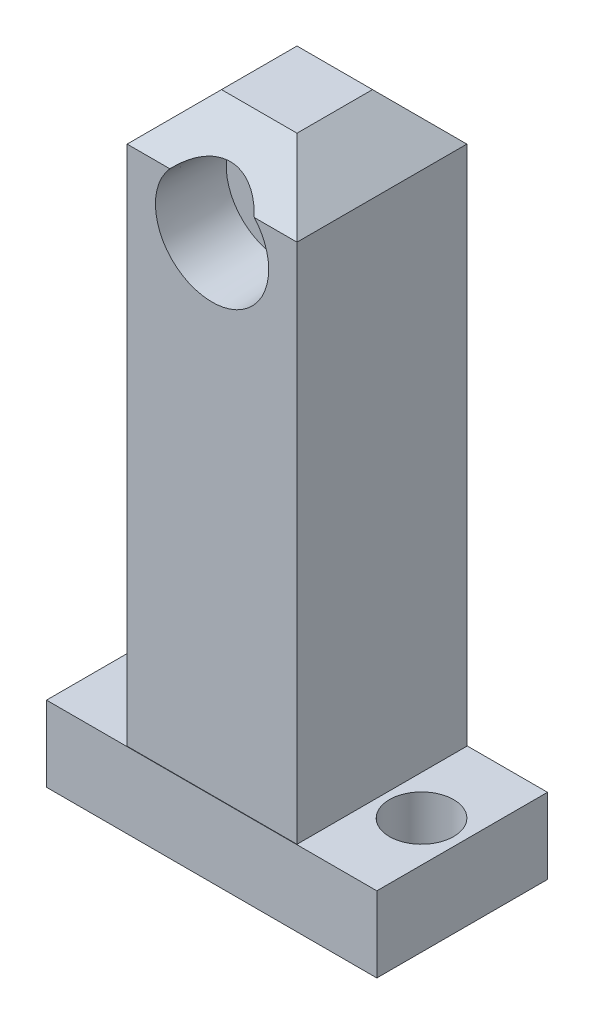
ISO-10303-21;
HEADER;
FILE_DESCRIPTION(('STEP AP214'),'2;1');
FILE_NAME('part.step','',(''),(''),'','','');
FILE_SCHEMA(('AUTOMOTIVE_DESIGN { 1 0 10303 214 1 1 1 1 }'));
ENDSEC;
DATA;
#1=APPLICATION_CONTEXT('core data for automotive mechanical design processes');
#2=APPLICATION_PROTOCOL_DEFINITION('international standard','automotive_design',2000,#1);
#3=PRODUCT_CONTEXT('',#1,'mechanical');
#4=PRODUCT('Part','Part','',(#3));
#5=PRODUCT_RELATED_PRODUCT_CATEGORY('part','',(#4));
#6=PRODUCT_DEFINITION_FORMATION('','',#4);
#7=PRODUCT_DEFINITION_CONTEXT('part definition',#1,'design');
#8=PRODUCT_DEFINITION('design','',#6,#7);
#9=PRODUCT_DEFINITION_SHAPE('','',#8);
#10=(LENGTH_UNIT() NAMED_UNIT(*) SI_UNIT(.MILLI.,.METRE.));
#11=(NAMED_UNIT(*) PLANE_ANGLE_UNIT() SI_UNIT($,.RADIAN.));
#12=(NAMED_UNIT(*) SI_UNIT($,.STERADIAN.) SOLID_ANGLE_UNIT());
#13=UNCERTAINTY_MEASURE_WITH_UNIT(LENGTH_MEASURE(1.E-05),#10,'distance_accuracy_value','');
#14=(GEOMETRIC_REPRESENTATION_CONTEXT(3) GLOBAL_UNCERTAINTY_ASSIGNED_CONTEXT((#13)) GLOBAL_UNIT_ASSIGNED_CONTEXT((#10,
#11,#12)) REPRESENTATION_CONTEXT('',''));
#15=CARTESIAN_POINT('',(0.,0.,0.));
#16=DIRECTION('',(0.,0.,1.));
#17=DIRECTION('',(1.,0.,0.));
#18=AXIS2_PLACEMENT_3D('',#15,#16,#17);
#19=CARTESIAN_POINT('',(0.,0.,-9.));
#20=DIRECTION('',(0.,0.,1.));
#21=DIRECTION('',(1.,0.,0.));
#22=AXIS2_PLACEMENT_3D('',#19,#20,#21);
#23=CYLINDRICAL_SURFACE('',#22,3.15);
#24=CARTESIAN_POINT('',(0.,0.,1.75));
#25=DIRECTION('',(0.,0.,1.));
#26=DIRECTION('',(1.,0.,0.));
#27=AXIS2_PLACEMENT_3D('',#24,#25,#26);
#28=CIRCLE('',#27,3.15);
#29=CARTESIAN_POINT('',(3.15,0.,1.75));
#30=VERTEX_POINT('',#29);
#31=EDGE_CURVE('E202',#30,#30,#28,.F.);
#32=ORIENTED_EDGE('',*,*,#31,.F.);
#33=EDGE_LOOP('',(#32));
#34=FACE_BOUND('',#33,.T.);
#35=CARTESIAN_POINT('',(0.,0.,-1.75));
#36=DIRECTION('',(0.,0.,-1.));
#37=DIRECTION('',(-1.,0.,0.));
#38=AXIS2_PLACEMENT_3D('',#35,#36,#37);
#39=CIRCLE('',#38,3.15);
#40=CARTESIAN_POINT('',(-3.15,0.,-1.75));
#41=VERTEX_POINT('',#40);
#42=EDGE_CURVE('E193',#41,#41,#39,.F.);
#43=ORIENTED_EDGE('',*,*,#42,.F.);
#44=EDGE_LOOP('',(#43));
#45=FACE_BOUND('',#44,.T.);
#46=ADVANCED_FACE('F47',(#34,#45),#23,.F.);
#47=CARTESIAN_POINT('',(9.,9.,-9.));
#48=DIRECTION('',(-1.,0.,0.));
#49=DIRECTION('',(0.,0.,1.));
#50=AXIS2_PLACEMENT_3D('',#47,#48,#49);
#51=PLANE('',#50);
#52=DIRECTION('',(0.,-1.,0.));
#53=VECTOR('',#52,1.);
#54=CARTESIAN_POINT('',(9.,9.,9.));
#55=LINE('',#54,#53);
#56=CARTESIAN_POINT('',(9.,3.99999999999998,9.));
#57=VERTEX_POINT('',#56);
#58=CARTESIAN_POINT('',(9.,-51.25,9.));
#59=VERTEX_POINT('',#58);
#60=EDGE_CURVE('E203',#57,#59,#55,.T.);
#61=ORIENTED_EDGE('',*,*,#60,.T.);
#62=DIRECTION('',(0.,0.,-1.));
#63=VECTOR('',#62,1.);
#64=CARTESIAN_POINT('',(9.,-51.25,-9.));
#65=LINE('',#64,#63);
#66=CARTESIAN_POINT('',(9.,-51.25,-9.));
#67=VERTEX_POINT('',#66);
#68=EDGE_CURVE('E64',#59,#67,#65,.T.);
#69=ORIENTED_EDGE('',*,*,#68,.T.);
#70=DIRECTION('',(0.,-1.,0.));
#71=VECTOR('',#70,1.);
#72=CARTESIAN_POINT('',(9.,9.,-9.));
#73=LINE('',#72,#71);
#74=CARTESIAN_POINT('',(9.,3.99999999999998,-9.));
#75=VERTEX_POINT('',#74);
#76=EDGE_CURVE('E215',#75,#67,#73,.T.);
#77=ORIENTED_EDGE('',*,*,#76,.F.);
#78=DIRECTION('',(0.,0.,1.));
#79=VECTOR('',#78,1.);
#80=CARTESIAN_POINT('',(9.,3.99999999999998,9.));
#81=LINE('',#80,#79);
#82=EDGE_CURVE('E57',#75,#57,#81,.T.);
#83=ORIENTED_EDGE('',*,*,#82,.T.);
#84=EDGE_LOOP('',(#61,#69,#77,#83));
#85=FACE_BOUND('',#84,.T.);
#86=ADVANCED_FACE('F301',(#85),#51,.F.);
#87=CARTESIAN_POINT('',(-9.,9.,-9.));
#88=DIRECTION('',(0.,0.,1.));
#89=DIRECTION('',(1.,0.,0.));
#90=AXIS2_PLACEMENT_3D('',#87,#88,#89);
#91=PLANE('',#90);
#92=ORIENTED_EDGE('',*,*,#76,.T.);
#93=DIRECTION('',(-1.,0.,0.));
#94=VECTOR('',#93,1.);
#95=CARTESIAN_POINT('',(-9.,-51.25,-9.));
#96=LINE('',#95,#94);
#97=CARTESIAN_POINT('',(-9.,-51.25,-9.));
#98=VERTEX_POINT('',#97);
#99=EDGE_CURVE('E172',#67,#98,#96,.T.);
#100=ORIENTED_EDGE('',*,*,#99,.T.);
#101=DIRECTION('',(0.,-1.,0.));
#102=VECTOR('',#101,1.);
#103=CARTESIAN_POINT('',(-9.,9.,-9.));
#104=LINE('',#103,#102);
#105=CARTESIAN_POINT('',(-9.,3.99999999999998,-9.));
#106=VERTEX_POINT('',#105);
#107=EDGE_CURVE('E211',#106,#98,#104,.T.);
#108=ORIENTED_EDGE('',*,*,#107,.F.);
#109=DIRECTION('',(1.,0.,0.));
#110=VECTOR('',#109,1.);
#111=CARTESIAN_POINT('',(9.,3.99999999999998,-9.));
#112=LINE('',#111,#110);
#113=CARTESIAN_POINT('',(-4.4721359549996,3.99999999999998,-9.));
#114=VERTEX_POINT('',#113);
#115=EDGE_CURVE('E252',#106,#114,#112,.T.);
#116=ORIENTED_EDGE('',*,*,#115,.T.);
#117=CARTESIAN_POINT('',(0.,0.,-9.));
#118=DIRECTION('',(0.,0.,-1.));
#119=DIRECTION('',(-1.,0.,0.));
#120=AXIS2_PLACEMENT_3D('',#117,#118,#119);
#121=CIRCLE('',#120,6.);
#122=CARTESIAN_POINT('',(4.4721359549996,3.99999999999998,-9.));
#123=VERTEX_POINT('',#122);
#124=EDGE_CURVE('E184',#123,#114,#121,.T.);
#125=ORIENTED_EDGE('',*,*,#124,.F.);
#126=DIRECTION('',(1.,0.,0.));
#127=VECTOR('',#126,1.);
#128=CARTESIAN_POINT('',(9.,3.99999999999998,-9.));
#129=LINE('',#128,#127);
#130=EDGE_CURVE('E71',#123,#75,#129,.T.);
#131=ORIENTED_EDGE('',*,*,#130,.T.);
#132=EDGE_LOOP('',(#92,#100,#108,#116,#125,#131));
#133=FACE_BOUND('',#132,.T.);
#134=ADVANCED_FACE('F283',(#133),#91,.F.);
#135=CARTESIAN_POINT('',(-9.,9.,-9.));
#136=DIRECTION('',(1.,0.,0.));
#137=DIRECTION('',(0.,0.,-1.));
#138=AXIS2_PLACEMENT_3D('',#135,#136,#137);
#139=PLANE('',#138);
#140=ORIENTED_EDGE('',*,*,#107,.T.);
#141=DIRECTION('',(0.,0.,1.));
#142=VECTOR('',#141,1.);
#143=CARTESIAN_POINT('',(-9.,-51.25,-9.));
#144=LINE('',#143,#142);
#145=CARTESIAN_POINT('',(-9.,-51.25,9.));
#146=VERTEX_POINT('',#145);
#147=EDGE_CURVE('E167',#98,#146,#144,.T.);
#148=ORIENTED_EDGE('',*,*,#147,.T.);
#149=DIRECTION('',(0.,-1.,0.));
#150=VECTOR('',#149,1.);
#151=CARTESIAN_POINT('',(-9.,9.,9.));
#152=LINE('',#151,#150);
#153=CARTESIAN_POINT('',(-9.,3.99999999999998,9.));
#154=VERTEX_POINT('',#153);
#155=EDGE_CURVE('E207',#154,#146,#152,.T.);
#156=ORIENTED_EDGE('',*,*,#155,.F.);
#157=DIRECTION('',(0.,0.,-1.));
#158=VECTOR('',#157,1.);
#159=CARTESIAN_POINT('',(-9.,3.99999999999998,-9.));
#160=LINE('',#159,#158);
#161=EDGE_CURVE('E247',#154,#106,#160,.T.);
#162=ORIENTED_EDGE('',*,*,#161,.T.);
#163=EDGE_LOOP('',(#140,#148,#156,#162));
#164=FACE_BOUND('',#163,.T.);
#165=ADVANCED_FACE('F322',(#164),#139,.F.);
#166=CARTESIAN_POINT('',(-9.,9.,9.));
#167=DIRECTION('',(0.,0.,-1.));
#168=DIRECTION('',(-1.,0.,0.));
#169=AXIS2_PLACEMENT_3D('',#166,#167,#168);
#170=PLANE('',#169);
#171=ORIENTED_EDGE('',*,*,#155,.T.);
#172=DIRECTION('',(1.,0.,0.));
#173=VECTOR('',#172,1.);
#174=CARTESIAN_POINT('',(-9.,-51.25,9.));
#175=LINE('',#174,#173);
#176=EDGE_CURVE('E11',#146,#59,#175,.T.);
#177=ORIENTED_EDGE('',*,*,#176,.T.);
#178=ORIENTED_EDGE('',*,*,#60,.F.);
#179=DIRECTION('',(-1.,0.,0.));
#180=VECTOR('',#179,1.);
#181=CARTESIAN_POINT('',(-9.,3.99999999999998,9.));
#182=LINE('',#181,#180);
#183=CARTESIAN_POINT('',(4.4721359549996,3.99999999999998,9.));
#184=VERTEX_POINT('',#183);
#185=EDGE_CURVE('E240',#57,#184,#182,.T.);
#186=ORIENTED_EDGE('',*,*,#185,.T.);
#187=CARTESIAN_POINT('',(0.,0.,9.));
#188=DIRECTION('',(0.,0.,1.));
#189=DIRECTION('',(1.,0.,0.));
#190=AXIS2_PLACEMENT_3D('',#187,#188,#189);
#191=CIRCLE('',#190,6.);
#192=CARTESIAN_POINT('',(-4.4721359549996,3.99999999999998,9.));
#193=VERTEX_POINT('',#192);
#194=EDGE_CURVE('E194',#193,#184,#191,.T.);
#195=ORIENTED_EDGE('',*,*,#194,.F.);
#196=DIRECTION('',(-1.,0.,0.));
#197=VECTOR('',#196,1.);
#198=CARTESIAN_POINT('',(-9.,3.99999999999998,9.));
#199=LINE('',#198,#197);
#200=EDGE_CURVE('E237',#193,#154,#199,.T.);
#201=ORIENTED_EDGE('',*,*,#200,.T.);
#202=EDGE_LOOP('',(#171,#177,#178,#186,#195,#201));
#203=FACE_BOUND('',#202,.T.);
#204=ADVANCED_FACE('F318',(#203),#170,.F.);
#205=CARTESIAN_POINT('',(0.,9.,0.));
#206=DIRECTION('',(0.,1.,0.));
#207=DIRECTION('',(0.,0.,1.));
#208=AXIS2_PLACEMENT_3D('',#205,#206,#207);
#209=PLANE('',#208);
#210=DIRECTION('',(0.,0.,1.));
#211=VECTOR('',#210,1.);
#212=CARTESIAN_POINT('',(-4.,9.,9.));
#213=LINE('',#212,#211);
#214=CARTESIAN_POINT('',(-4.,9.,-4.));
#215=VERTEX_POINT('',#214);
#216=CARTESIAN_POINT('',(-4.,9.,4.));
#217=VERTEX_POINT('',#216);
#218=EDGE_CURVE('E230',#215,#217,#213,.T.);
#219=ORIENTED_EDGE('',*,*,#218,.T.);
#220=DIRECTION('',(1.,0.,0.));
#221=VECTOR('',#220,1.);
#222=CARTESIAN_POINT('',(9.,9.,4.));
#223=LINE('',#222,#221);
#224=CARTESIAN_POINT('',(4.,9.,4.));
#225=VERTEX_POINT('',#224);
#226=EDGE_CURVE('E233',#217,#225,#223,.T.);
#227=ORIENTED_EDGE('',*,*,#226,.T.);
#228=DIRECTION('',(0.,0.,-1.));
#229=VECTOR('',#228,1.);
#230=CARTESIAN_POINT('',(4.,9.,-9.));
#231=LINE('',#230,#229);
#232=CARTESIAN_POINT('',(4.,9.,-4.));
#233=VERTEX_POINT('',#232);
#234=EDGE_CURVE('E218',#225,#233,#231,.T.);
#235=ORIENTED_EDGE('',*,*,#234,.T.);
#236=DIRECTION('',(-1.,0.,0.));
#237=VECTOR('',#236,1.);
#238=CARTESIAN_POINT('',(-9.,9.,-4.));
#239=LINE('',#238,#237);
#240=EDGE_CURVE('E227',#233,#215,#239,.T.);
#241=ORIENTED_EDGE('',*,*,#240,.T.);
#242=EDGE_LOOP('',(#219,#227,#235,#241));
#243=FACE_BOUND('',#242,.T.);
#244=ADVANCED_FACE('F314',(#243),#209,.T.);
#245=CARTESIAN_POINT('',(0.,0.,1.75));
#246=DIRECTION('',(0.,0.,1.));
#247=DIRECTION('',(1.,0.,0.));
#248=AXIS2_PLACEMENT_3D('',#245,#246,#247);
#249=PLANE('',#248);
#250=CARTESIAN_POINT('',(0.,0.,1.75));
#251=DIRECTION('',(0.,0.,1.));
#252=DIRECTION('',(1.,0.,0.));
#253=AXIS2_PLACEMENT_3D('',#250,#251,#252);
#254=CIRCLE('',#253,5.74682442118483);
#255=CARTESIAN_POINT('',(5.74682442118483,0.,1.75));
#256=VERTEX_POINT('',#255);
#257=EDGE_CURVE('E198',#256,#256,#254,.T.);
#258=ORIENTED_EDGE('',*,*,#257,.T.);
#259=EDGE_LOOP('',(#258));
#260=FACE_BOUND('',#259,.T.);
#261=ORIENTED_EDGE('',*,*,#31,.T.);
#262=EDGE_LOOP('',(#261));
#263=FACE_BOUND('',#262,.T.);
#264=ADVANCED_FACE('F317',(#260,#263),#249,.T.);
#265=CARTESIAN_POINT('',(0.,0.,9.));
#266=DIRECTION('',(0.,0.,1.));
#267=DIRECTION('',(1.,0.,0.));
#268=AXIS2_PLACEMENT_3D('',#265,#266,#267);
#269=CONICAL_SURFACE('',#268,6.,0.0349065850398866);
#270=ORIENTED_EDGE('',*,*,#257,.F.);
#271=EDGE_LOOP('',(#270));
#272=FACE_BOUND('',#271,.T.);
#273=ORIENTED_EDGE('',*,*,#194,.T.);
#274=CARTESIAN_POINT('',(0.,-0.214664231992874,13.2146642319928));
#275=DIRECTION('',(0.,0.707106781186546,0.707106781186549));
#276=DIRECTION('',(0.,-0.707106781186549,0.707106781186546));
#277=AXIS2_PLACEMENT_3D('',#274,#275,#276);
#278=ELLIPSE('',#277,8.69342436203958,6.14343005468075);
#279=EDGE_CURVE('E244',#184,#193,#278,.T.);
#280=ORIENTED_EDGE('',*,*,#279,.T.);
#281=EDGE_LOOP('',(#273,#280));
#282=FACE_BOUND('',#281,.T.);
#283=ADVANCED_FACE('F295',(#272,#282),#269,.F.);
#284=CARTESIAN_POINT('',(0.,0.,-1.75));
#285=DIRECTION('',(0.,0.,-1.));
#286=DIRECTION('',(-1.,0.,0.));
#287=AXIS2_PLACEMENT_3D('',#284,#285,#286);
#288=PLANE('',#287);
#289=CARTESIAN_POINT('',(0.,0.,-1.75));
#290=DIRECTION('',(0.,0.,-1.));
#291=DIRECTION('',(-1.,0.,0.));
#292=AXIS2_PLACEMENT_3D('',#289,#290,#291);
#293=CIRCLE('',#292,5.74682442118483);
#294=CARTESIAN_POINT('',(-5.74682442118483,0.,-1.75));
#295=VERTEX_POINT('',#294);
#296=EDGE_CURVE('E188',#295,#295,#293,.T.);
#297=ORIENTED_EDGE('',*,*,#296,.T.);
#298=EDGE_LOOP('',(#297));
#299=FACE_BOUND('',#298,.T.);
#300=ORIENTED_EDGE('',*,*,#42,.T.);
#301=EDGE_LOOP('',(#300));
#302=FACE_BOUND('',#301,.T.);
#303=ADVANCED_FACE('F287',(#299,#302),#288,.T.);
#304=CARTESIAN_POINT('',(0.,0.,-9.));
#305=DIRECTION('',(0.,0.,-1.));
#306=DIRECTION('',(-1.,0.,0.));
#307=AXIS2_PLACEMENT_3D('',#304,#305,#306);
#308=CONICAL_SURFACE('',#307,6.,0.0349065850398866);
#309=ORIENTED_EDGE('',*,*,#296,.F.);
#310=EDGE_LOOP('',(#309));
#311=FACE_BOUND('',#310,.T.);
#312=ORIENTED_EDGE('',*,*,#124,.T.);
#313=CARTESIAN_POINT('',(0.,-0.214664231992874,-13.2146642319928));
#314=DIRECTION('',(0.,0.707106781186546,-0.707106781186549));
#315=DIRECTION('',(0.,-0.707106781186549,-0.707106781186546));
#316=AXIS2_PLACEMENT_3D('',#313,#314,#315);
#317=ELLIPSE('',#316,8.69342436203958,6.14343005468075);
#318=EDGE_CURVE('E255',#114,#123,#317,.T.);
#319=ORIENTED_EDGE('',*,*,#318,.T.);
#320=EDGE_LOOP('',(#312,#319));
#321=FACE_BOUND('',#320,.T.);
#322=ADVANCED_FACE('F285',(#311,#321),#308,.F.);
#323=CARTESIAN_POINT('',(0.,9.,-4.));
#324=DIRECTION('',(0.,0.707106781186546,-0.707106781186549));
#325=DIRECTION('',(1.,0.,0.));
#326=AXIS2_PLACEMENT_3D('',#323,#324,#325);
#327=PLANE('',#326);
#328=ORIENTED_EDGE('',*,*,#318,.F.);
#329=ORIENTED_EDGE('',*,*,#115,.F.);
#330=DIRECTION('',(0.577350269189625,0.577350269189627,0.577350269189625));
#331=VECTOR('',#330,1.);
#332=CARTESIAN_POINT('',(-2.66666666666667,10.3333333333333,-2.66666666666667));
#333=LINE('',#332,#331);
#334=EDGE_CURVE('E189',#215,#106,#333,.F.);
#335=ORIENTED_EDGE('',*,*,#334,.F.);
#336=ORIENTED_EDGE('',*,*,#240,.F.);
#337=DIRECTION('',(-0.577350269189625,0.577350269189627,0.577350269189625));
#338=VECTOR('',#337,1.);
#339=CARTESIAN_POINT('',(2.66666666666667,10.3333333333333,-2.66666666666667));
#340=LINE('',#339,#338);
#341=EDGE_CURVE('E266',#75,#233,#340,.T.);
#342=ORIENTED_EDGE('',*,*,#341,.F.);
#343=ORIENTED_EDGE('',*,*,#130,.F.);
#344=EDGE_LOOP('',(#328,#329,#335,#336,#342,#343));
#345=FACE_BOUND('',#344,.T.);
#346=ADVANCED_FACE('F50',(#345),#327,.T.);
#347=CARTESIAN_POINT('',(-4.,9.,0.));
#348=DIRECTION('',(-0.707106781186549,0.707106781186546,0.));
#349=DIRECTION('',(0.,0.,-1.));
#350=AXIS2_PLACEMENT_3D('',#347,#348,#349);
#351=PLANE('',#350);
#352=ORIENTED_EDGE('',*,*,#334,.T.);
#353=ORIENTED_EDGE('',*,*,#161,.F.);
#354=DIRECTION('',(0.577350269189625,0.577350269189627,-0.577350269189625));
#355=VECTOR('',#354,1.);
#356=CARTESIAN_POINT('',(-2.66666666666667,10.3333333333333,2.66666666666667));
#357=LINE('',#356,#355);
#358=EDGE_CURVE('E262',#217,#154,#357,.F.);
#359=ORIENTED_EDGE('',*,*,#358,.F.);
#360=ORIENTED_EDGE('',*,*,#218,.F.);
#361=EDGE_LOOP('',(#352,#353,#359,#360));
#362=FACE_BOUND('',#361,.T.);
#363=ADVANCED_FACE('F275',(#362),#351,.T.);
#364=CARTESIAN_POINT('',(4.,9.,0.));
#365=DIRECTION('',(0.707106781186549,0.707106781186546,0.));
#366=DIRECTION('',(0.,0.,1.));
#367=AXIS2_PLACEMENT_3D('',#364,#365,#366);
#368=PLANE('',#367);
#369=ORIENTED_EDGE('',*,*,#341,.T.);
#370=ORIENTED_EDGE('',*,*,#234,.F.);
#371=DIRECTION('',(0.577350269189625,-0.577350269189627,0.577350269189625));
#372=VECTOR('',#371,1.);
#373=CARTESIAN_POINT('',(2.66666666666667,10.3333333333333,2.66666666666667));
#374=LINE('',#373,#372);
#375=EDGE_CURVE('E183',#57,#225,#374,.F.);
#376=ORIENTED_EDGE('',*,*,#375,.F.);
#377=ORIENTED_EDGE('',*,*,#82,.F.);
#378=EDGE_LOOP('',(#369,#370,#376,#377));
#379=FACE_BOUND('',#378,.T.);
#380=ADVANCED_FACE('F336',(#379),#368,.T.);
#381=CARTESIAN_POINT('',(0.,9.,4.));
#382=DIRECTION('',(0.,0.707106781186546,0.707106781186549));
#383=DIRECTION('',(-1.,0.,0.));
#384=AXIS2_PLACEMENT_3D('',#381,#382,#383);
#385=PLANE('',#384);
#386=ORIENTED_EDGE('',*,*,#279,.F.);
#387=ORIENTED_EDGE('',*,*,#185,.F.);
#388=ORIENTED_EDGE('',*,*,#375,.T.);
#389=ORIENTED_EDGE('',*,*,#226,.F.);
#390=ORIENTED_EDGE('',*,*,#358,.T.);
#391=ORIENTED_EDGE('',*,*,#200,.F.);
#392=EDGE_LOOP('',(#386,#387,#388,#389,#390,#391));
#393=FACE_BOUND('',#392,.T.);
#394=ADVANCED_FACE('F330',(#393),#385,.T.);
#395=CARTESIAN_POINT('',(0.,-51.25,0.));
#396=DIRECTION('',(0.,1.,0.));
#397=DIRECTION('',(0.,0.,1.));
#398=AXIS2_PLACEMENT_3D('',#395,#396,#397);
#399=PLANE('',#398);
#400=CARTESIAN_POINT('',(13.1944525508818,-51.25,0.));
#401=DIRECTION('',(0.,1.,0.));
#402=DIRECTION('',(0.,0.,1.));
#403=AXIS2_PLACEMENT_3D('',#400,#401,#402);
#404=CIRCLE('',#403,3.4);
#405=CARTESIAN_POINT('',(13.1944525508818,-51.25,3.4));
#406=VERTEX_POINT('',#405);
#407=EDGE_CURVE('E536',#406,#406,#404,.T.);
#408=ORIENTED_EDGE('',*,*,#407,.F.);
#409=EDGE_LOOP('',(#408));
#410=FACE_BOUND('',#409,.T.);
#411=CARTESIAN_POINT('',(-13.0699765834207,-51.25,0.));
#412=DIRECTION('',(0.,1.,0.));
#413=DIRECTION('',(0.,0.,1.));
#414=AXIS2_PLACEMENT_3D('',#411,#412,#413);
#415=CIRCLE('',#414,3.4);
#416=CARTESIAN_POINT('',(-13.0699765834207,-51.25,3.4));
#417=VERTEX_POINT('',#416);
#418=EDGE_CURVE('E540',#417,#417,#415,.T.);
#419=ORIENTED_EDGE('',*,*,#418,.F.);
#420=EDGE_LOOP('',(#419));
#421=FACE_BOUND('',#420,.T.);
#422=DIRECTION('',(1.,0.,0.));
#423=VECTOR('',#422,1.);
#424=CARTESIAN_POINT('',(-17.5,-51.25,9.04190862510142));
#425=LINE('',#424,#423);
#426=CARTESIAN_POINT('',(-17.5,-51.25,9.04190862510142));
#427=VERTEX_POINT('',#426);
#428=CARTESIAN_POINT('',(17.5,-51.25,9.04190862510142));
#429=VERTEX_POINT('',#428);
#430=EDGE_CURVE('E152',#427,#429,#425,.T.);
#431=ORIENTED_EDGE('',*,*,#430,.T.);
#432=DIRECTION('',(0.,0.,-1.));
#433=VECTOR('',#432,1.);
#434=CARTESIAN_POINT('',(17.5,-51.25,9.04190862510142));
#435=LINE('',#434,#433);
#436=CARTESIAN_POINT('',(17.5,-51.25,-9.04190862510142));
#437=VERTEX_POINT('',#436);
#438=EDGE_CURVE('E139',#429,#437,#435,.T.);
#439=ORIENTED_EDGE('',*,*,#438,.T.);
#440=DIRECTION('',(1.,0.,0.));
#441=VECTOR('',#440,1.);
#442=CARTESIAN_POINT('',(-17.5,-51.25,-9.04190862510142));
#443=LINE('',#442,#441);
#444=CARTESIAN_POINT('',(-17.5,-51.25,-9.04190862510142));
#445=VERTEX_POINT('',#444);
#446=EDGE_CURVE('E151',#445,#437,#443,.T.);
#447=ORIENTED_EDGE('',*,*,#446,.F.);
#448=DIRECTION('',(0.,0.,-1.));
#449=VECTOR('',#448,1.);
#450=CARTESIAN_POINT('',(-17.5,-51.25,9.04190862510142));
#451=LINE('',#450,#449);
#452=EDGE_CURVE('E158',#427,#445,#451,.T.);
#453=ORIENTED_EDGE('',*,*,#452,.F.);
#454=EDGE_LOOP('',(#431,#439,#447,#453));
#455=FACE_BOUND('',#454,.T.);
#456=ORIENTED_EDGE('',*,*,#68,.F.);
#457=ORIENTED_EDGE('',*,*,#176,.F.);
#458=ORIENTED_EDGE('',*,*,#147,.F.);
#459=ORIENTED_EDGE('',*,*,#99,.F.);
#460=EDGE_LOOP('',(#456,#457,#458,#459));
#461=FACE_BOUND('',#460,.T.);
#462=ADVANCED_FACE('F156',(#410,#421,#455,#461),#399,.T.);
#463=CARTESIAN_POINT('',(-17.5,-51.25,9.04190862510142));
#464=DIRECTION('',(0.,0.,-1.));
#465=DIRECTION('',(-1.,0.,0.));
#466=AXIS2_PLACEMENT_3D('',#463,#464,#465);
#467=PLANE('',#466);
#468=DIRECTION('',(1.,0.,0.));
#469=VECTOR('',#468,1.);
#470=CARTESIAN_POINT('',(-17.5,-59.25,9.04190862510142));
#471=LINE('',#470,#469);
#472=CARTESIAN_POINT('',(-17.5,-59.25,9.04190862510142));
#473=VERTEX_POINT('',#472);
#474=CARTESIAN_POINT('',(17.5,-59.25,9.04190862510142));
#475=VERTEX_POINT('',#474);
#476=EDGE_CURVE('E165',#473,#475,#471,.T.);
#477=ORIENTED_EDGE('',*,*,#476,.T.);
#478=DIRECTION('',(0.,-1.,0.));
#479=VECTOR('',#478,1.);
#480=CARTESIAN_POINT('',(17.5,-51.25,9.04190862510142));
#481=LINE('',#480,#479);
#482=EDGE_CURVE('E144',#429,#475,#481,.T.);
#483=ORIENTED_EDGE('',*,*,#482,.F.);
#484=ORIENTED_EDGE('',*,*,#430,.F.);
#485=DIRECTION('',(0.,-1.,0.));
#486=VECTOR('',#485,1.);
#487=CARTESIAN_POINT('',(-17.5,-51.25,9.04190862510142));
#488=LINE('',#487,#486);
#489=EDGE_CURVE('E554',#427,#473,#488,.T.);
#490=ORIENTED_EDGE('',*,*,#489,.T.);
#491=EDGE_LOOP('',(#477,#483,#484,#490));
#492=FACE_BOUND('',#491,.T.);
#493=ADVANCED_FACE('F163',(#492),#467,.F.);
#494=CARTESIAN_POINT('',(17.5,-51.25,9.04190862510142));
#495=DIRECTION('',(-1.,0.,0.));
#496=DIRECTION('',(0.,0.,1.));
#497=AXIS2_PLACEMENT_3D('',#494,#495,#496);
#498=PLANE('',#497);
#499=DIRECTION('',(0.,0.,-1.));
#500=VECTOR('',#499,1.);
#501=CARTESIAN_POINT('',(17.5,-59.25,9.04190862510142));
#502=LINE('',#501,#500);
#503=CARTESIAN_POINT('',(17.5,-59.25,-9.04190862510142));
#504=VERTEX_POINT('',#503);
#505=EDGE_CURVE('E557',#475,#504,#502,.T.);
#506=ORIENTED_EDGE('',*,*,#505,.T.);
#507=DIRECTION('',(0.,-1.,0.));
#508=VECTOR('',#507,1.);
#509=CARTESIAN_POINT('',(17.5,-51.25,-9.04190862510142));
#510=LINE('',#509,#508);
#511=EDGE_CURVE('E146',#437,#504,#510,.T.);
#512=ORIENTED_EDGE('',*,*,#511,.F.);
#513=ORIENTED_EDGE('',*,*,#438,.F.);
#514=ORIENTED_EDGE('',*,*,#482,.T.);
#515=EDGE_LOOP('',(#506,#512,#513,#514));
#516=FACE_BOUND('',#515,.T.);
#517=ADVANCED_FACE('F142',(#516),#498,.F.);
#518=CARTESIAN_POINT('',(-17.5,-51.25,-9.04190862510142));
#519=DIRECTION('',(0.,0.,-1.));
#520=DIRECTION('',(-1.,0.,0.));
#521=AXIS2_PLACEMENT_3D('',#518,#519,#520);
#522=PLANE('',#521);
#523=DIRECTION('',(1.,0.,0.));
#524=VECTOR('',#523,1.);
#525=CARTESIAN_POINT('',(-17.5,-59.25,-9.04190862510142));
#526=LINE('',#525,#524);
#527=CARTESIAN_POINT('',(-17.5,-59.25,-9.04190862510142));
#528=VERTEX_POINT('',#527);
#529=EDGE_CURVE('E560',#528,#504,#526,.T.);
#530=ORIENTED_EDGE('',*,*,#529,.F.);
#531=DIRECTION('',(0.,-1.,0.));
#532=VECTOR('',#531,1.);
#533=CARTESIAN_POINT('',(-17.5,-51.25,-9.04190862510142));
#534=LINE('',#533,#532);
#535=EDGE_CURVE('E174',#445,#528,#534,.T.);
#536=ORIENTED_EDGE('',*,*,#535,.F.);
#537=ORIENTED_EDGE('',*,*,#446,.T.);
#538=ORIENTED_EDGE('',*,*,#511,.T.);
#539=EDGE_LOOP('',(#530,#536,#537,#538));
#540=FACE_BOUND('',#539,.T.);
#541=ADVANCED_FACE('F396',(#540),#522,.T.);
#542=CARTESIAN_POINT('',(-17.5,-51.25,9.04190862510142));
#543=DIRECTION('',(-1.,0.,0.));
#544=DIRECTION('',(0.,0.,1.));
#545=AXIS2_PLACEMENT_3D('',#542,#543,#544);
#546=PLANE('',#545);
#547=DIRECTION('',(0.,0.,-1.));
#548=VECTOR('',#547,1.);
#549=CARTESIAN_POINT('',(-17.5,-59.25,9.04190862510142));
#550=LINE('',#549,#548);
#551=EDGE_CURVE('E161',#473,#528,#550,.T.);
#552=ORIENTED_EDGE('',*,*,#551,.F.);
#553=ORIENTED_EDGE('',*,*,#489,.F.);
#554=ORIENTED_EDGE('',*,*,#452,.T.);
#555=ORIENTED_EDGE('',*,*,#535,.T.);
#556=EDGE_LOOP('',(#552,#553,#554,#555));
#557=FACE_BOUND('',#556,.T.);
#558=ADVANCED_FACE('F404',(#557),#546,.T.);
#559=CARTESIAN_POINT('',(0.,-59.25,0.));
#560=DIRECTION('',(0.,-1.,0.));
#561=DIRECTION('',(0.,0.,-1.));
#562=AXIS2_PLACEMENT_3D('',#559,#560,#561);
#563=PLANE('',#562);
#564=CARTESIAN_POINT('',(13.1944525508818,-59.25,0.));
#565=DIRECTION('',(0.,1.,0.));
#566=DIRECTION('',(0.,0.,1.));
#567=AXIS2_PLACEMENT_3D('',#564,#565,#566);
#568=CIRCLE('',#567,3.4);
#569=CARTESIAN_POINT('',(13.1944525508818,-59.25,3.4));
#570=VERTEX_POINT('',#569);
#571=EDGE_CURVE('E533',#570,#570,#568,.T.);
#572=ORIENTED_EDGE('',*,*,#571,.T.);
#573=EDGE_LOOP('',(#572));
#574=FACE_BOUND('',#573,.T.);
#575=CARTESIAN_POINT('',(-13.0699765834207,-59.25,0.));
#576=DIRECTION('',(0.,1.,0.));
#577=DIRECTION('',(0.,0.,1.));
#578=AXIS2_PLACEMENT_3D('',#575,#576,#577);
#579=CIRCLE('',#578,3.4);
#580=CARTESIAN_POINT('',(-13.0699765834207,-59.25,3.4));
#581=VERTEX_POINT('',#580);
#582=EDGE_CURVE('E543',#581,#581,#579,.T.);
#583=ORIENTED_EDGE('',*,*,#582,.T.);
#584=EDGE_LOOP('',(#583));
#585=FACE_BOUND('',#584,.T.);
#586=ORIENTED_EDGE('',*,*,#476,.F.);
#587=ORIENTED_EDGE('',*,*,#551,.T.);
#588=ORIENTED_EDGE('',*,*,#529,.T.);
#589=ORIENTED_EDGE('',*,*,#505,.F.);
#590=EDGE_LOOP('',(#586,#587,#588,#589));
#591=FACE_BOUND('',#590,.T.);
#592=ADVANCED_FACE('F413',(#574,#585,#591),#563,.T.);
#593=CARTESIAN_POINT('',(-13.0699765834207,-59.25,0.));
#594=DIRECTION('',(0.,1.,0.));
#595=DIRECTION('',(0.,0.,1.));
#596=AXIS2_PLACEMENT_3D('',#593,#594,#595);
#597=CYLINDRICAL_SURFACE('',#596,3.4);
#598=ORIENTED_EDGE('',*,*,#582,.F.);
#599=EDGE_LOOP('',(#598));
#600=FACE_BOUND('',#599,.T.);
#601=ORIENTED_EDGE('',*,*,#418,.T.);
#602=EDGE_LOOP('',(#601));
#603=FACE_BOUND('',#602,.T.);
#604=ADVANCED_FACE('F420',(#600,#603),#597,.F.);
#605=CARTESIAN_POINT('',(13.1944525508818,-59.25,0.));
#606=DIRECTION('',(0.,1.,0.));
#607=DIRECTION('',(0.,0.,1.));
#608=AXIS2_PLACEMENT_3D('',#605,#606,#607);
#609=CYLINDRICAL_SURFACE('',#608,3.4);
#610=ORIENTED_EDGE('',*,*,#571,.F.);
#611=EDGE_LOOP('',(#610));
#612=FACE_BOUND('',#611,.T.);
#613=ORIENTED_EDGE('',*,*,#407,.T.);
#614=EDGE_LOOP('',(#613));
#615=FACE_BOUND('',#614,.T.);
#616=ADVANCED_FACE('F424',(#612,#615),#609,.F.);
#617=CLOSED_SHELL('',(#46,#86,#134,#165,#204,#244,#264,#283,#303,#322,#346,#363,#380,#394,#462,
#493,#517,#541,#558,#592,#604,#616));
#618=MANIFOLD_SOLID_BREP('B2',#617);
#619=ADVANCED_BREP_SHAPE_REPRESENTATION('',(#18,#618),#14);
#620=SHAPE_DEFINITION_REPRESENTATION(#9,#619);
ENDSEC;
END-ISO-10303-21;
